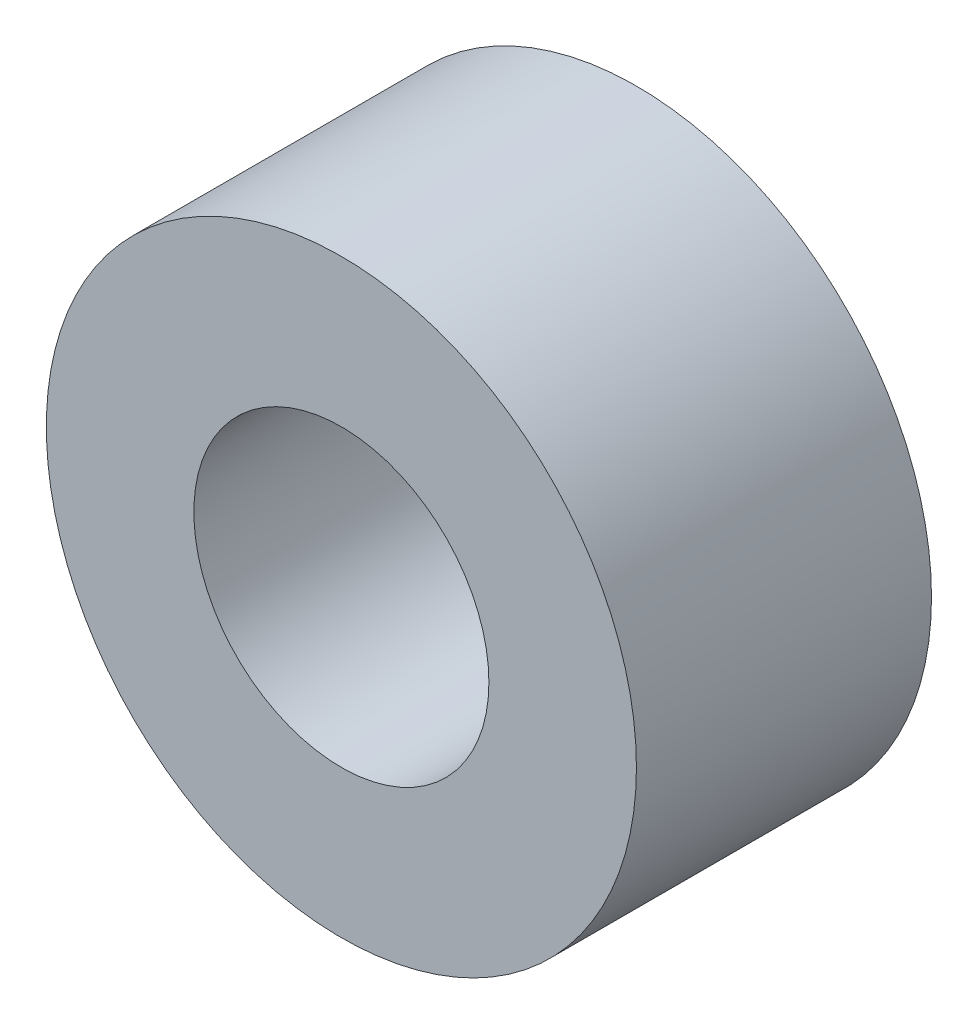
ISO-10303-21;
HEADER;
FILE_DESCRIPTION(('STEP AP214'),'2;1');
FILE_NAME('part.step','',(''),(''),'','','');
FILE_SCHEMA(('AUTOMOTIVE_DESIGN { 1 0 10303 214 1 1 1 1 }'));
ENDSEC;
DATA;
#1=APPLICATION_CONTEXT('core data for automotive mechanical design processes');
#2=APPLICATION_PROTOCOL_DEFINITION('international standard','automotive_design',2000,#1);
#3=PRODUCT_CONTEXT('',#1,'mechanical');
#4=PRODUCT('Part','Part','',(#3));
#5=PRODUCT_RELATED_PRODUCT_CATEGORY('part','',(#4));
#6=PRODUCT_DEFINITION_FORMATION('','',#4);
#7=PRODUCT_DEFINITION_CONTEXT('part definition',#1,'design');
#8=PRODUCT_DEFINITION('design','',#6,#7);
#9=PRODUCT_DEFINITION_SHAPE('','',#8);
#10=(LENGTH_UNIT() NAMED_UNIT(*) SI_UNIT(.MILLI.,.METRE.));
#11=(NAMED_UNIT(*) PLANE_ANGLE_UNIT() SI_UNIT($,.RADIAN.));
#12=(NAMED_UNIT(*) SI_UNIT($,.STERADIAN.) SOLID_ANGLE_UNIT());
#13=UNCERTAINTY_MEASURE_WITH_UNIT(LENGTH_MEASURE(1.E-05),#10,'distance_accuracy_value','');
#14=(GEOMETRIC_REPRESENTATION_CONTEXT(3) GLOBAL_UNCERTAINTY_ASSIGNED_CONTEXT((#13)) GLOBAL_UNIT_ASSIGNED_CONTEXT((#10,
#11,#12)) REPRESENTATION_CONTEXT('',''));
#15=CARTESIAN_POINT('',(0.,0.,0.));
#16=DIRECTION('',(0.,0.,1.));
#17=DIRECTION('',(1.,0.,0.));
#18=AXIS2_PLACEMENT_3D('',#15,#16,#17);
#19=CARTESIAN_POINT('',(0.,0.,3.));
#20=DIRECTION('',(0.,0.,1.));
#21=DIRECTION('',(1.,0.,0.));
#22=AXIS2_PLACEMENT_3D('',#19,#20,#21);
#23=PLANE('',#22);
#24=CARTESIAN_POINT('',(0.,0.,3.));
#25=DIRECTION('',(0.,0.,1.));
#26=DIRECTION('',(1.,0.,0.));
#27=AXIS2_PLACEMENT_3D('',#24,#25,#26);
#28=CIRCLE('',#27,3.);
#29=CARTESIAN_POINT('',(3.,0.,3.));
#30=VERTEX_POINT('',#29);
#31=EDGE_CURVE('E10',#30,#30,#28,.T.);
#32=ORIENTED_EDGE('',*,*,#31,.T.);
#33=EDGE_LOOP('',(#32));
#34=FACE_BOUND('',#33,.T.);
#35=CARTESIAN_POINT('',(0.,0.,3.));
#36=DIRECTION('',(0.,0.,1.));
#37=DIRECTION('',(1.,0.,0.));
#38=AXIS2_PLACEMENT_3D('',#35,#36,#37);
#39=CIRCLE('',#38,1.5);
#40=CARTESIAN_POINT('',(1.5,0.,3.));
#41=VERTEX_POINT('',#40);
#42=EDGE_CURVE('E50',#41,#41,#39,.T.);
#43=ORIENTED_EDGE('',*,*,#42,.F.);
#44=EDGE_LOOP('',(#43));
#45=FACE_BOUND('',#44,.T.);
#46=ADVANCED_FACE('F37',(#34,#45),#23,.T.);
#47=CARTESIAN_POINT('',(0.,0.,0.));
#48=DIRECTION('',(0.,0.,1.));
#49=DIRECTION('',(1.,0.,0.));
#50=AXIS2_PLACEMENT_3D('',#47,#48,#49);
#51=PLANE('',#50);
#52=CARTESIAN_POINT('',(0.,0.,0.));
#53=DIRECTION('',(0.,0.,1.));
#54=DIRECTION('',(1.,0.,0.));
#55=AXIS2_PLACEMENT_3D('',#52,#53,#54);
#56=CIRCLE('',#55,3.);
#57=CARTESIAN_POINT('',(3.,0.,0.));
#58=VERTEX_POINT('',#57);
#59=EDGE_CURVE('E41',#58,#58,#56,.T.);
#60=ORIENTED_EDGE('',*,*,#59,.F.);
#61=EDGE_LOOP('',(#60));
#62=FACE_BOUND('',#61,.T.);
#63=CARTESIAN_POINT('',(0.,0.,0.));
#64=DIRECTION('',(0.,0.,1.));
#65=DIRECTION('',(1.,0.,0.));
#66=AXIS2_PLACEMENT_3D('',#63,#64,#65);
#67=CIRCLE('',#66,1.5);
#68=CARTESIAN_POINT('',(1.5,0.,0.));
#69=VERTEX_POINT('',#68);
#70=EDGE_CURVE('E52',#69,#69,#67,.T.);
#71=ORIENTED_EDGE('',*,*,#70,.T.);
#72=EDGE_LOOP('',(#71));
#73=FACE_BOUND('',#72,.T.);
#74=ADVANCED_FACE('F64',(#62,#73),#51,.F.);
#75=CARTESIAN_POINT('',(0.,0.,3.));
#76=DIRECTION('',(0.,0.,-1.));
#77=DIRECTION('',(-1.,0.,0.));
#78=AXIS2_PLACEMENT_3D('',#75,#76,#77);
#79=CYLINDRICAL_SURFACE('',#78,3.);
#80=ORIENTED_EDGE('',*,*,#31,.F.);
#81=EDGE_LOOP('',(#80));
#82=FACE_BOUND('',#81,.T.);
#83=ORIENTED_EDGE('',*,*,#59,.T.);
#84=EDGE_LOOP('',(#83));
#85=FACE_BOUND('',#84,.T.);
#86=ADVANCED_FACE('F39',(#82,#85),#79,.T.);
#87=CARTESIAN_POINT('',(0.,0.,3.));
#88=DIRECTION('',(0.,0.,-1.));
#89=DIRECTION('',(-1.,0.,0.));
#90=AXIS2_PLACEMENT_3D('',#87,#88,#89);
#91=CYLINDRICAL_SURFACE('',#90,1.5);
#92=ORIENTED_EDGE('',*,*,#42,.T.);
#93=EDGE_LOOP('',(#92));
#94=FACE_BOUND('',#93,.T.);
#95=ORIENTED_EDGE('',*,*,#70,.F.);
#96=EDGE_LOOP('',(#95));
#97=FACE_BOUND('',#96,.T.);
#98=ADVANCED_FACE('F60',(#94,#97),#91,.F.);
#99=CLOSED_SHELL('',(#46,#74,#86,#98));
#100=MANIFOLD_SOLID_BREP('B2',#99);
#101=ADVANCED_BREP_SHAPE_REPRESENTATION('',(#18,#100),#14);
#102=SHAPE_DEFINITION_REPRESENTATION(#9,#101);
ENDSEC;
END-ISO-10303-21;
